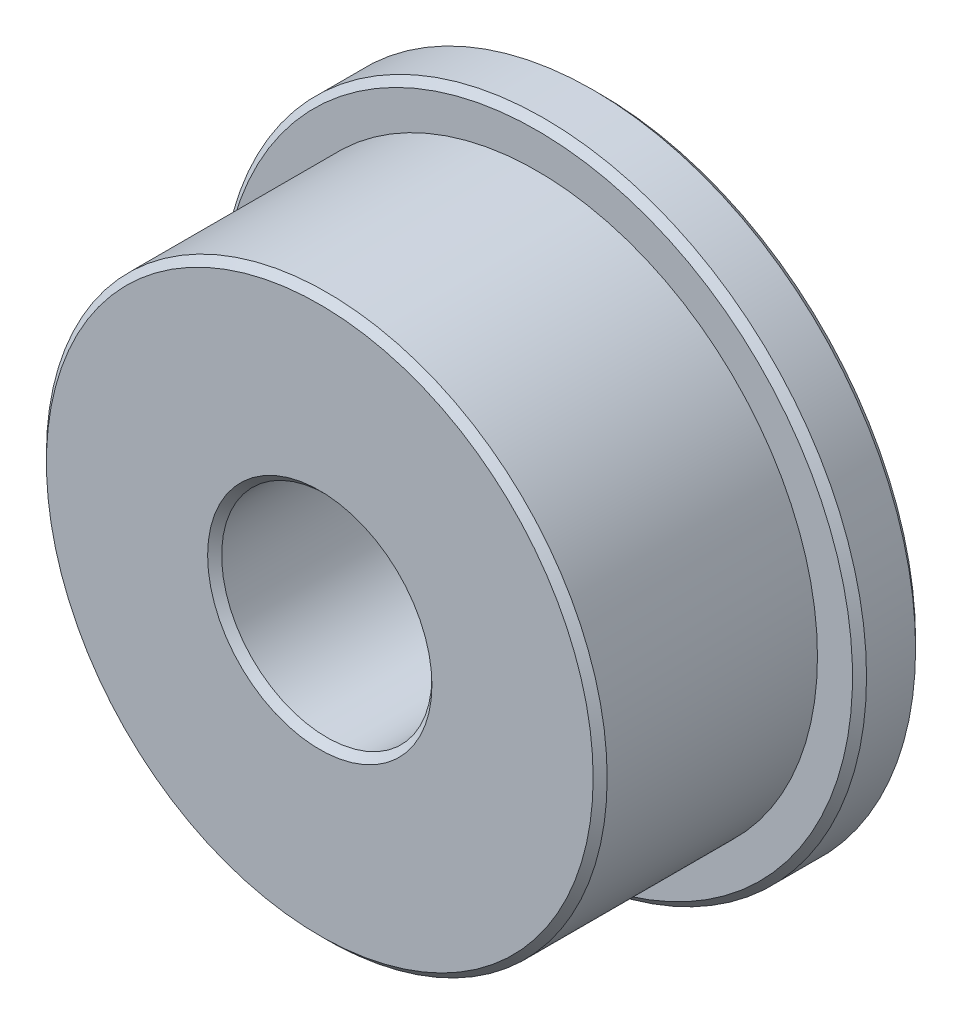
ISO-10303-21;
HEADER;
FILE_DESCRIPTION(('STEP AP214'),'2;1');
FILE_NAME('part.step','',(''),(''),'','','');
FILE_SCHEMA(('AUTOMOTIVE_DESIGN { 1 0 10303 214 1 1 1 1 }'));
ENDSEC;
DATA;
#1=APPLICATION_CONTEXT('core data for automotive mechanical design processes');
#2=APPLICATION_PROTOCOL_DEFINITION('international standard','automotive_design',2000,#1);
#3=PRODUCT_CONTEXT('',#1,'mechanical');
#4=PRODUCT('Part','Part','',(#3));
#5=PRODUCT_RELATED_PRODUCT_CATEGORY('part','',(#4));
#6=PRODUCT_DEFINITION_FORMATION('','',#4);
#7=PRODUCT_DEFINITION_CONTEXT('part definition',#1,'design');
#8=PRODUCT_DEFINITION('design','',#6,#7);
#9=PRODUCT_DEFINITION_SHAPE('','',#8);
#10=(LENGTH_UNIT() NAMED_UNIT(*) SI_UNIT(.MILLI.,.METRE.));
#11=(NAMED_UNIT(*) PLANE_ANGLE_UNIT() SI_UNIT($,.RADIAN.));
#12=(NAMED_UNIT(*) SI_UNIT($,.STERADIAN.) SOLID_ANGLE_UNIT());
#13=UNCERTAINTY_MEASURE_WITH_UNIT(LENGTH_MEASURE(1.E-05),#10,'distance_accuracy_value','');
#14=(GEOMETRIC_REPRESENTATION_CONTEXT(3) GLOBAL_UNCERTAINTY_ASSIGNED_CONTEXT((#13)) GLOBAL_UNIT_ASSIGNED_CONTEXT((#10,
#11,#12)) REPRESENTATION_CONTEXT('',''));
#15=CARTESIAN_POINT('',(0.,0.,0.));
#16=DIRECTION('',(0.,0.,1.));
#17=DIRECTION('',(1.,0.,0.));
#18=AXIS2_PLACEMENT_3D('',#15,#16,#17);
#19=CARTESIAN_POINT('',(0.,0.,2.));
#20=DIRECTION('',(0.,0.,-1.));
#21=DIRECTION('',(-1.,0.,0.));
#22=AXIS2_PLACEMENT_3D('',#19,#20,#21);
#23=CYLINDRICAL_SURFACE('',#22,4.);
#24=CARTESIAN_POINT('',(0.,0.,1.9));
#25=DIRECTION('',(0.,0.,1.));
#26=DIRECTION('',(1.,0.,0.));
#27=AXIS2_PLACEMENT_3D('',#24,#25,#26);
#28=CIRCLE('',#27,4.);
#29=CARTESIAN_POINT('',(4.,0.,1.9));
#30=VERTEX_POINT('',#29);
#31=EDGE_CURVE('E53',#30,#30,#28,.F.);
#32=ORIENTED_EDGE('',*,*,#31,.T.);
#33=EDGE_LOOP('',(#32));
#34=FACE_BOUND('',#33,.T.);
#35=CARTESIAN_POINT('',(0.,0.,-1.1));
#36=DIRECTION('',(0.,0.,-1.));
#37=DIRECTION('',(-1.,0.,0.));
#38=AXIS2_PLACEMENT_3D('',#35,#36,#37);
#39=CIRCLE('',#38,4.);
#40=CARTESIAN_POINT('',(-4.,0.,-1.1));
#41=VERTEX_POINT('',#40);
#42=EDGE_CURVE('E76',#41,#41,#39,.T.);
#43=ORIENTED_EDGE('',*,*,#42,.F.);
#44=EDGE_LOOP('',(#43));
#45=FACE_BOUND('',#44,.T.);
#46=ADVANCED_FACE('F37',(#34,#45),#23,.T.);
#47=CARTESIAN_POINT('',(0.,0.,2.));
#48=DIRECTION('',(0.,0.,1.));
#49=DIRECTION('',(1.,0.,0.));
#50=AXIS2_PLACEMENT_3D('',#47,#48,#49);
#51=PLANE('',#50);
#52=CARTESIAN_POINT('',(0.,0.,2.));
#53=DIRECTION('',(0.,0.,1.));
#54=DIRECTION('',(1.,0.,0.));
#55=AXIS2_PLACEMENT_3D('',#52,#53,#54);
#56=CIRCLE('',#55,1.6);
#57=CARTESIAN_POINT('',(1.6,0.,2.));
#58=VERTEX_POINT('',#57);
#59=EDGE_CURVE('E58',#58,#58,#56,.F.);
#60=ORIENTED_EDGE('',*,*,#59,.T.);
#61=EDGE_LOOP('',(#60));
#62=FACE_BOUND('',#61,.T.);
#63=CARTESIAN_POINT('',(0.,0.,2.));
#64=DIRECTION('',(0.,0.,1.));
#65=DIRECTION('',(1.,0.,0.));
#66=AXIS2_PLACEMENT_3D('',#63,#64,#65);
#67=CIRCLE('',#66,3.9);
#68=CARTESIAN_POINT('',(3.9,0.,2.));
#69=VERTEX_POINT('',#68);
#70=EDGE_CURVE('E61',#69,#69,#67,.T.);
#71=ORIENTED_EDGE('',*,*,#70,.T.);
#72=EDGE_LOOP('',(#71));
#73=FACE_BOUND('',#72,.T.);
#74=ADVANCED_FACE('F83',(#62,#73),#51,.T.);
#75=CARTESIAN_POINT('',(0.,0.,-2.));
#76=DIRECTION('',(0.,0.,1.));
#77=DIRECTION('',(1.,0.,0.));
#78=AXIS2_PLACEMENT_3D('',#75,#76,#77);
#79=PLANE('',#78);
#80=CARTESIAN_POINT('',(0.,0.,-2.));
#81=DIRECTION('',(0.,0.,1.));
#82=DIRECTION('',(1.,0.,0.));
#83=AXIS2_PLACEMENT_3D('',#80,#81,#82);
#84=CIRCLE('',#83,1.6);
#85=CARTESIAN_POINT('',(1.6,0.,-2.));
#86=VERTEX_POINT('',#85);
#87=EDGE_CURVE('E70',#86,#86,#84,.T.);
#88=ORIENTED_EDGE('',*,*,#87,.T.);
#89=EDGE_LOOP('',(#88));
#90=FACE_BOUND('',#89,.T.);
#91=CARTESIAN_POINT('',(0.,0.,-2.));
#92=DIRECTION('',(0.,0.,1.));
#93=DIRECTION('',(1.,0.,0.));
#94=AXIS2_PLACEMENT_3D('',#91,#92,#93);
#95=CIRCLE('',#94,4.5);
#96=CARTESIAN_POINT('',(4.5,0.,-2.));
#97=VERTEX_POINT('',#96);
#98=EDGE_CURVE('E73',#97,#97,#95,.F.);
#99=ORIENTED_EDGE('',*,*,#98,.T.);
#100=EDGE_LOOP('',(#99));
#101=FACE_BOUND('',#100,.T.);
#102=ADVANCED_FACE('F89',(#90,#101),#79,.F.);
#103=CARTESIAN_POINT('',(0.,0.,2.));
#104=DIRECTION('',(0.,0.,-1.));
#105=DIRECTION('',(-1.,0.,0.));
#106=AXIS2_PLACEMENT_3D('',#103,#104,#105);
#107=CYLINDRICAL_SURFACE('',#106,1.5);
#108=CARTESIAN_POINT('',(0.,0.,-1.9));
#109=DIRECTION('',(0.,0.,1.));
#110=DIRECTION('',(1.,0.,0.));
#111=AXIS2_PLACEMENT_3D('',#108,#109,#110);
#112=CIRCLE('',#111,1.5);
#113=CARTESIAN_POINT('',(1.5,0.,-1.9));
#114=VERTEX_POINT('',#113);
#115=EDGE_CURVE('E64',#114,#114,#112,.F.);
#116=ORIENTED_EDGE('',*,*,#115,.T.);
#117=EDGE_LOOP('',(#116));
#118=FACE_BOUND('',#117,.T.);
#119=CARTESIAN_POINT('',(0.,0.,1.9));
#120=DIRECTION('',(0.,0.,1.));
#121=DIRECTION('',(1.,0.,0.));
#122=AXIS2_PLACEMENT_3D('',#119,#120,#121);
#123=CIRCLE('',#122,1.5);
#124=CARTESIAN_POINT('',(1.5,0.,1.9));
#125=VERTEX_POINT('',#124);
#126=EDGE_CURVE('E67',#125,#125,#123,.T.);
#127=ORIENTED_EDGE('',*,*,#126,.T.);
#128=EDGE_LOOP('',(#127));
#129=FACE_BOUND('',#128,.T.);
#130=ADVANCED_FACE('F128',(#118,#129),#107,.F.);
#131=CARTESIAN_POINT('',(0.,0.,-1.1));
#132=DIRECTION('',(0.,0.,-1.));
#133=DIRECTION('',(-1.,0.,0.));
#134=AXIS2_PLACEMENT_3D('',#131,#132,#133);
#135=CYLINDRICAL_SURFACE('',#134,4.6);
#136=CARTESIAN_POINT('',(0.,0.,-1.9));
#137=DIRECTION('',(0.,0.,1.));
#138=DIRECTION('',(1.,0.,0.));
#139=AXIS2_PLACEMENT_3D('',#136,#137,#138);
#140=CIRCLE('',#139,4.6);
#141=CARTESIAN_POINT('',(4.6,0.,-1.9));
#142=VERTEX_POINT('',#141);
#143=EDGE_CURVE('E45',#142,#142,#140,.T.);
#144=ORIENTED_EDGE('',*,*,#143,.T.);
#145=EDGE_LOOP('',(#144));
#146=FACE_BOUND('',#145,.T.);
#147=CARTESIAN_POINT('',(0.,0.,-1.2));
#148=DIRECTION('',(0.,0.,-1.));
#149=DIRECTION('',(-1.,0.,0.));
#150=AXIS2_PLACEMENT_3D('',#147,#148,#149);
#151=CIRCLE('',#150,4.6);
#152=CARTESIAN_POINT('',(-4.6,0.,-1.2));
#153=VERTEX_POINT('',#152);
#154=EDGE_CURVE('E49',#153,#153,#151,.T.);
#155=ORIENTED_EDGE('',*,*,#154,.T.);
#156=EDGE_LOOP('',(#155));
#157=FACE_BOUND('',#156,.T.);
#158=ADVANCED_FACE('F133',(#146,#157),#135,.T.);
#159=CARTESIAN_POINT('',(0.,0.,-1.1));
#160=DIRECTION('',(0.,0.,-1.));
#161=DIRECTION('',(-1.,0.,0.));
#162=AXIS2_PLACEMENT_3D('',#159,#160,#161);
#163=PLANE('',#162);
#164=CARTESIAN_POINT('',(0.,0.,-1.1));
#165=DIRECTION('',(0.,0.,-1.));
#166=DIRECTION('',(-1.,0.,0.));
#167=AXIS2_PLACEMENT_3D('',#164,#165,#166);
#168=CIRCLE('',#167,4.5);
#169=CARTESIAN_POINT('',(-4.5,0.,-1.1));
#170=VERTEX_POINT('',#169);
#171=EDGE_CURVE('E10',#170,#170,#168,.F.);
#172=ORIENTED_EDGE('',*,*,#171,.T.);
#173=EDGE_LOOP('',(#172));
#174=FACE_BOUND('',#173,.T.);
#175=ORIENTED_EDGE('',*,*,#42,.T.);
#176=EDGE_LOOP('',(#175));
#177=FACE_BOUND('',#176,.T.);
#178=ADVANCED_FACE('F80',(#174,#177),#163,.F.);
#179=CARTESIAN_POINT('',(0.,0.,-2.));
#180=DIRECTION('',(0.,0.,-1.));
#181=DIRECTION('',(-1.,0.,0.));
#182=AXIS2_PLACEMENT_3D('',#179,#180,#181);
#183=CONICAL_SURFACE('',#182,1.6,0.785398163397444);
#184=ORIENTED_EDGE('',*,*,#115,.F.);
#185=EDGE_LOOP('',(#184));
#186=FACE_BOUND('',#185,.T.);
#187=ORIENTED_EDGE('',*,*,#87,.F.);
#188=EDGE_LOOP('',(#187));
#189=FACE_BOUND('',#188,.T.);
#190=ADVANCED_FACE('F95',(#186,#189),#183,.F.);
#191=CARTESIAN_POINT('',(0.,0.,1.9));
#192=DIRECTION('',(0.,0.,1.));
#193=DIRECTION('',(1.,0.,0.));
#194=AXIS2_PLACEMENT_3D('',#191,#192,#193);
#195=CONICAL_SURFACE('',#194,1.5,0.785398163397443);
#196=ORIENTED_EDGE('',*,*,#59,.F.);
#197=EDGE_LOOP('',(#196));
#198=FACE_BOUND('',#197,.T.);
#199=ORIENTED_EDGE('',*,*,#126,.F.);
#200=EDGE_LOOP('',(#199));
#201=FACE_BOUND('',#200,.T.);
#202=ADVANCED_FACE('F101',(#198,#201),#195,.F.);
#203=CARTESIAN_POINT('',(0.,0.,2.));
#204=DIRECTION('',(0.,0.,-1.));
#205=DIRECTION('',(-1.,0.,0.));
#206=AXIS2_PLACEMENT_3D('',#203,#204,#205);
#207=CONICAL_SURFACE('',#206,3.9,0.785398163397448);
#208=ORIENTED_EDGE('',*,*,#31,.F.);
#209=EDGE_LOOP('',(#208));
#210=FACE_BOUND('',#209,.T.);
#211=ORIENTED_EDGE('',*,*,#70,.F.);
#212=EDGE_LOOP('',(#211));
#213=FACE_BOUND('',#212,.T.);
#214=ADVANCED_FACE('F108',(#210,#213),#207,.T.);
#215=CARTESIAN_POINT('',(0.,0.,-2.));
#216=DIRECTION('',(0.,0.,1.));
#217=DIRECTION('',(1.,0.,0.));
#218=AXIS2_PLACEMENT_3D('',#215,#216,#217);
#219=CONICAL_SURFACE('',#218,4.5,0.785398163397448);
#220=ORIENTED_EDGE('',*,*,#143,.F.);
#221=EDGE_LOOP('',(#220));
#222=FACE_BOUND('',#221,.T.);
#223=ORIENTED_EDGE('',*,*,#98,.F.);
#224=EDGE_LOOP('',(#223));
#225=FACE_BOUND('',#224,.T.);
#226=ADVANCED_FACE('F114',(#222,#225),#219,.T.);
#227=CARTESIAN_POINT('',(0.,0.,-1.2));
#228=DIRECTION('',(0.,0.,-1.));
#229=DIRECTION('',(-1.,0.,0.));
#230=AXIS2_PLACEMENT_3D('',#227,#228,#229);
#231=CONICAL_SURFACE('',#230,4.6,0.785398163397444);
#232=ORIENTED_EDGE('',*,*,#171,.F.);
#233=EDGE_LOOP('',(#232));
#234=FACE_BOUND('',#233,.T.);
#235=ORIENTED_EDGE('',*,*,#154,.F.);
#236=EDGE_LOOP('',(#235));
#237=FACE_BOUND('',#236,.T.);
#238=ADVANCED_FACE('F40',(#234,#237),#231,.T.);
#239=CLOSED_SHELL('',(#46,#74,#102,#130,#158,#178,#190,#202,#214,#226,#238));
#240=MANIFOLD_SOLID_BREP('B2',#239);
#241=ADVANCED_BREP_SHAPE_REPRESENTATION('',(#18,#240),#14);
#242=SHAPE_DEFINITION_REPRESENTATION(#9,#241);
ENDSEC;
END-ISO-10303-21;
